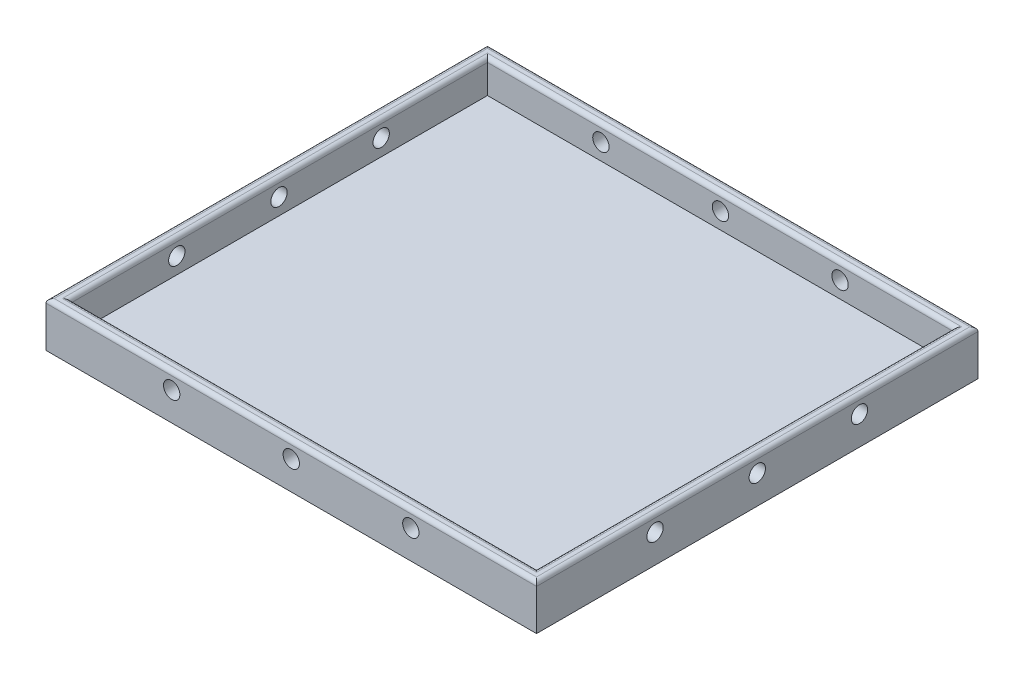
ISO-10303-21;
HEADER;
FILE_DESCRIPTION(('STEP AP214'),'2;1');
FILE_NAME('part.step','',(''),(''),'','','');
FILE_SCHEMA(('AUTOMOTIVE_DESIGN { 1 0 10303 214 1 1 1 1 }'));
ENDSEC;
DATA;
#1=APPLICATION_CONTEXT('core data for automotive mechanical design processes');
#2=APPLICATION_PROTOCOL_DEFINITION('international standard','automotive_design',2000,#1);
#3=PRODUCT_CONTEXT('',#1,'mechanical');
#4=PRODUCT('Part','Part','',(#3));
#5=PRODUCT_RELATED_PRODUCT_CATEGORY('part','',(#4));
#6=PRODUCT_DEFINITION_FORMATION('','',#4);
#7=PRODUCT_DEFINITION_CONTEXT('part definition',#1,'design');
#8=PRODUCT_DEFINITION('design','',#6,#7);
#9=PRODUCT_DEFINITION_SHAPE('','',#8);
#10=(LENGTH_UNIT() NAMED_UNIT(*) SI_UNIT(.MILLI.,.METRE.));
#11=(NAMED_UNIT(*) PLANE_ANGLE_UNIT() SI_UNIT($,.RADIAN.));
#12=(NAMED_UNIT(*) SI_UNIT($,.STERADIAN.) SOLID_ANGLE_UNIT());
#13=UNCERTAINTY_MEASURE_WITH_UNIT(LENGTH_MEASURE(1.E-05),#10,'distance_accuracy_value','');
#14=(GEOMETRIC_REPRESENTATION_CONTEXT(3) GLOBAL_UNCERTAINTY_ASSIGNED_CONTEXT((#13)) GLOBAL_UNIT_ASSIGNED_CONTEXT((#10,
#11,#12)) REPRESENTATION_CONTEXT('',''));
#15=CARTESIAN_POINT('',(0.,0.,0.));
#16=DIRECTION('',(0.,0.,1.));
#17=DIRECTION('',(1.,0.,0.));
#18=AXIS2_PLACEMENT_3D('',#15,#16,#17);
#19=CARTESIAN_POINT('',(-201.609907120743,11.,-77.8947368421052));
#20=DIRECTION('',(1.,0.,0.));
#21=DIRECTION('',(0.,0.,-1.));
#22=AXIS2_PLACEMENT_3D('',#19,#20,#21);
#23=PLANE('',#22);
#24=CARTESIAN_POINT('',(-201.609907120743,6.99999997663109,1.10526315789477));
#25=DIRECTION('',(1.,0.,0.));
#26=DIRECTION('',(0.,0.,-1.));
#27=AXIS2_PLACEMENT_3D('',#24,#25,#26);
#28=CIRCLE('',#27,1.9999999931676);
#29=CARTESIAN_POINT('',(-201.609907120743,6.99999997663109,-0.894736835272832));
#30=VERTEX_POINT('',#29);
#31=EDGE_CURVE('E191',#30,#30,#28,.T.);
#32=ORIENTED_EDGE('',*,*,#31,.T.);
#33=EDGE_LOOP('',(#32));
#34=FACE_BOUND('',#33,.T.);
#35=CARTESIAN_POINT('',(-201.609907120743,6.99999997663109,-23.8947368421052));
#36=DIRECTION('',(1.,0.,0.));
#37=DIRECTION('',(0.,0.,-1.));
#38=AXIS2_PLACEMENT_3D('',#35,#36,#37);
#39=CIRCLE('',#38,2.);
#40=CARTESIAN_POINT('',(-201.609907120743,6.99999997663109,-25.8947368421052));
#41=VERTEX_POINT('',#40);
#42=EDGE_CURVE('E594',#41,#41,#39,.T.);
#43=ORIENTED_EDGE('',*,*,#42,.T.);
#44=EDGE_LOOP('',(#43));
#45=FACE_BOUND('',#44,.T.);
#46=CARTESIAN_POINT('',(-201.609907120743,7.,-48.8947368421052));
#47=DIRECTION('',(1.,0.,0.));
#48=DIRECTION('',(0.,0.,-1.));
#49=AXIS2_PLACEMENT_3D('',#46,#47,#48);
#50=CIRCLE('',#49,2.);
#51=CARTESIAN_POINT('',(-201.609907120743,7.,-50.8947368421052));
#52=VERTEX_POINT('',#51);
#53=EDGE_CURVE('E587',#52,#52,#50,.T.);
#54=ORIENTED_EDGE('',*,*,#53,.T.);
#55=EDGE_LOOP('',(#54));
#56=FACE_BOUND('',#55,.T.);
#57=DIRECTION('',(0.,-1.,0.));
#58=VECTOR('',#57,1.);
#59=CARTESIAN_POINT('',(-201.609907120743,11.,30.1052631578948));
#60=LINE('',#59,#58);
#61=CARTESIAN_POINT('',(-201.609907120743,10.,30.1052631578948));
#62=VERTEX_POINT('',#61);
#63=CARTESIAN_POINT('',(-201.609907120743,0.,30.1052631578948));
#64=VERTEX_POINT('',#63);
#65=EDGE_CURVE('E184',#62,#64,#60,.T.);
#66=ORIENTED_EDGE('',*,*,#65,.F.);
#67=DIRECTION('',(0.,0.,1.));
#68=VECTOR('',#67,1.);
#69=CARTESIAN_POINT('',(-201.609907120743,10.,-77.8947368421052));
#70=LINE('',#69,#68);
#71=CARTESIAN_POINT('',(-201.609907120743,10.,-77.8947368421052));
#72=VERTEX_POINT('',#71);
#73=EDGE_CURVE('E45',#62,#72,#70,.F.);
#74=ORIENTED_EDGE('',*,*,#73,.T.);
#75=DIRECTION('',(0.,-1.,0.));
#76=VECTOR('',#75,1.);
#77=CARTESIAN_POINT('',(-201.609907120743,11.,-77.8947368421052));
#78=LINE('',#77,#76);
#79=CARTESIAN_POINT('',(-201.609907120743,0.,-77.8947368421052));
#80=VERTEX_POINT('',#79);
#81=EDGE_CURVE('E178',#72,#80,#78,.T.);
#82=ORIENTED_EDGE('',*,*,#81,.T.);
#83=DIRECTION('',(0.,0.,1.));
#84=VECTOR('',#83,1.);
#85=CARTESIAN_POINT('',(-201.609907120743,0.,-77.8947368421052));
#86=LINE('',#85,#84);
#87=EDGE_CURVE('E163',#80,#64,#86,.T.);
#88=ORIENTED_EDGE('',*,*,#87,.T.);
#89=EDGE_LOOP('',(#66,#74,#82,#88));
#90=FACE_BOUND('',#89,.T.);
#91=ADVANCED_FACE('F36',(#34,#45,#56,#90),#23,.F.);
#92=CARTESIAN_POINT('',(-201.609907120743,11.,30.1052631578948));
#93=DIRECTION('',(0.,0.,-1.));
#94=DIRECTION('',(-1.,0.,0.));
#95=AXIS2_PLACEMENT_3D('',#92,#93,#94);
#96=PLANE('',#95);
#97=CARTESIAN_POINT('',(-170.859907120743,7.,30.1052631578948));
#98=DIRECTION('',(0.,0.,1.));
#99=DIRECTION('',(1.,0.,0.));
#100=AXIS2_PLACEMENT_3D('',#97,#98,#99);
#101=CIRCLE('',#100,2.);
#102=CARTESIAN_POINT('',(-168.859907120743,7.,30.1052631578948));
#103=VERTEX_POINT('',#102);
#104=EDGE_CURVE('E622',#103,#103,#101,.T.);
#105=ORIENTED_EDGE('',*,*,#104,.F.);
#106=EDGE_LOOP('',(#105));
#107=FACE_BOUND('',#106,.T.);
#108=CARTESIAN_POINT('',(-141.609907120743,7.,30.1052631578948));
#109=DIRECTION('',(0.,0.,1.));
#110=DIRECTION('',(1.,0.,0.));
#111=AXIS2_PLACEMENT_3D('',#108,#109,#110);
#112=CIRCLE('',#111,2.);
#113=CARTESIAN_POINT('',(-139.609907120743,7.,30.1052631578948));
#114=VERTEX_POINT('',#113);
#115=EDGE_CURVE('E616',#114,#114,#112,.T.);
#116=ORIENTED_EDGE('',*,*,#115,.F.);
#117=EDGE_LOOP('',(#116));
#118=FACE_BOUND('',#117,.T.);
#119=CARTESIAN_POINT('',(-112.359907120743,7.,30.1052631578948));
#120=DIRECTION('',(0.,0.,1.));
#121=DIRECTION('',(1.,0.,0.));
#122=AXIS2_PLACEMENT_3D('',#119,#120,#121);
#123=CIRCLE('',#122,2.);
#124=CARTESIAN_POINT('',(-110.359907120743,7.,30.1052631578948));
#125=VERTEX_POINT('',#124);
#126=EDGE_CURVE('E250',#125,#125,#123,.T.);
#127=ORIENTED_EDGE('',*,*,#126,.F.);
#128=EDGE_LOOP('',(#127));
#129=FACE_BOUND('',#128,.T.);
#130=DIRECTION('',(0.,-1.,0.));
#131=VECTOR('',#130,1.);
#132=CARTESIAN_POINT('',(-81.6099071207431,11.,30.1052631578948));
#133=LINE('',#132,#131);
#134=CARTESIAN_POINT('',(-81.6099071207431,10.,30.1052631578948));
#135=VERTEX_POINT('',#134);
#136=CARTESIAN_POINT('',(-81.6099071207431,0.,30.1052631578948));
#137=VERTEX_POINT('',#136);
#138=EDGE_CURVE('E182',#135,#137,#133,.T.);
#139=ORIENTED_EDGE('',*,*,#138,.F.);
#140=DIRECTION('',(1.,0.,0.));
#141=VECTOR('',#140,1.);
#142=CARTESIAN_POINT('',(-201.609907120743,10.,30.1052631578948));
#143=LINE('',#142,#141);
#144=EDGE_CURVE('E230',#135,#62,#143,.F.);
#145=ORIENTED_EDGE('',*,*,#144,.T.);
#146=ORIENTED_EDGE('',*,*,#65,.T.);
#147=DIRECTION('',(1.,0.,0.));
#148=VECTOR('',#147,1.);
#149=CARTESIAN_POINT('',(-201.609907120743,0.,30.1052631578948));
#150=LINE('',#149,#148);
#151=EDGE_CURVE('E169',#64,#137,#150,.T.);
#152=ORIENTED_EDGE('',*,*,#151,.T.);
#153=EDGE_LOOP('',(#139,#145,#146,#152));
#154=FACE_BOUND('',#153,.T.);
#155=ADVANCED_FACE('F282',(#107,#118,#129,#154),#96,.F.);
#156=CARTESIAN_POINT('',(-81.6099071207431,11.,-77.8947368421052));
#157=DIRECTION('',(-1.,0.,0.));
#158=DIRECTION('',(0.,0.,1.));
#159=AXIS2_PLACEMENT_3D('',#156,#157,#158);
#160=PLANE('',#159);
#161=CARTESIAN_POINT('',(-81.6099071207431,6.99999997663109,1.10526315789477));
#162=DIRECTION('',(1.,0.,0.));
#163=DIRECTION('',(0.,0.,-1.));
#164=AXIS2_PLACEMENT_3D('',#161,#162,#163);
#165=CIRCLE('',#164,1.9999999931676);
#166=CARTESIAN_POINT('',(-81.6099071207431,6.99999997663109,-0.894736835272832));
#167=VERTEX_POINT('',#166);
#168=EDGE_CURVE('E579',#167,#167,#165,.T.);
#169=ORIENTED_EDGE('',*,*,#168,.F.);
#170=EDGE_LOOP('',(#169));
#171=FACE_BOUND('',#170,.T.);
#172=CARTESIAN_POINT('',(-81.6099071207431,6.99999997663109,-23.8947368421052));
#173=DIRECTION('',(1.,0.,0.));
#174=DIRECTION('',(0.,0.,-1.));
#175=AXIS2_PLACEMENT_3D('',#172,#173,#174);
#176=CIRCLE('',#175,2.);
#177=CARTESIAN_POINT('',(-81.6099071207431,6.99999997663109,-25.8947368421052));
#178=VERTEX_POINT('',#177);
#179=EDGE_CURVE('E583',#178,#178,#176,.T.);
#180=ORIENTED_EDGE('',*,*,#179,.F.);
#181=EDGE_LOOP('',(#180));
#182=FACE_BOUND('',#181,.T.);
#183=CARTESIAN_POINT('',(-81.6099071207431,7.,-48.8947368421052));
#184=DIRECTION('',(1.,0.,0.));
#185=DIRECTION('',(0.,0.,-1.));
#186=AXIS2_PLACEMENT_3D('',#183,#184,#185);
#187=CIRCLE('',#186,2.);
#188=CARTESIAN_POINT('',(-81.6099071207431,7.,-50.8947368421052));
#189=VERTEX_POINT('',#188);
#190=EDGE_CURVE('E586',#189,#189,#187,.T.);
#191=ORIENTED_EDGE('',*,*,#190,.F.);
#192=EDGE_LOOP('',(#191));
#193=FACE_BOUND('',#192,.T.);
#194=DIRECTION('',(0.,-1.,0.));
#195=VECTOR('',#194,1.);
#196=CARTESIAN_POINT('',(-81.6099071207431,11.,-77.8947368421052));
#197=LINE('',#196,#195);
#198=CARTESIAN_POINT('',(-81.6099071207431,10.,-77.8947368421052));
#199=VERTEX_POINT('',#198);
#200=CARTESIAN_POINT('',(-81.6099071207431,0.,-77.8947368421052));
#201=VERTEX_POINT('',#200);
#202=EDGE_CURVE('E180',#199,#201,#197,.T.);
#203=ORIENTED_EDGE('',*,*,#202,.F.);
#204=DIRECTION('',(0.,0.,-1.));
#205=VECTOR('',#204,1.);
#206=CARTESIAN_POINT('',(-81.6099071207431,10.,30.1052631578948));
#207=LINE('',#206,#205);
#208=EDGE_CURVE('E233',#199,#135,#207,.F.);
#209=ORIENTED_EDGE('',*,*,#208,.T.);
#210=ORIENTED_EDGE('',*,*,#138,.T.);
#211=DIRECTION('',(0.,0.,-1.));
#212=VECTOR('',#211,1.);
#213=CARTESIAN_POINT('',(-81.6099071207431,0.,-77.8947368421052));
#214=LINE('',#213,#212);
#215=EDGE_CURVE('E172',#137,#201,#214,.T.);
#216=ORIENTED_EDGE('',*,*,#215,.T.);
#217=EDGE_LOOP('',(#203,#209,#210,#216));
#218=FACE_BOUND('',#217,.T.);
#219=ADVANCED_FACE('F273',(#171,#182,#193,#218),#160,.F.);
#220=CARTESIAN_POINT('',(-201.609907120743,11.,-77.8947368421052));
#221=DIRECTION('',(0.,0.,1.));
#222=DIRECTION('',(1.,0.,0.));
#223=AXIS2_PLACEMENT_3D('',#220,#221,#222);
#224=PLANE('',#223);
#225=CARTESIAN_POINT('',(-170.859907120743,7.,-77.8947368421052));
#226=DIRECTION('',(0.,0.,1.));
#227=DIRECTION('',(1.,0.,0.));
#228=AXIS2_PLACEMENT_3D('',#225,#226,#227);
#229=CIRCLE('',#228,2.);
#230=CARTESIAN_POINT('',(-168.859907120743,7.,-77.8947368421052));
#231=VERTEX_POINT('',#230);
#232=EDGE_CURVE('E202',#231,#231,#229,.T.);
#233=ORIENTED_EDGE('',*,*,#232,.T.);
#234=EDGE_LOOP('',(#233));
#235=FACE_BOUND('',#234,.T.);
#236=CARTESIAN_POINT('',(-141.609907120743,7.,-77.8947368421052));
#237=DIRECTION('',(0.,0.,1.));
#238=DIRECTION('',(1.,0.,0.));
#239=AXIS2_PLACEMENT_3D('',#236,#237,#238);
#240=CIRCLE('',#239,2.);
#241=CARTESIAN_POINT('',(-139.609907120743,7.,-77.8947368421052));
#242=VERTEX_POINT('',#241);
#243=EDGE_CURVE('E619',#242,#242,#240,.T.);
#244=ORIENTED_EDGE('',*,*,#243,.T.);
#245=EDGE_LOOP('',(#244));
#246=FACE_BOUND('',#245,.T.);
#247=CARTESIAN_POINT('',(-112.359907120743,7.,-77.8947368421052));
#248=DIRECTION('',(0.,0.,1.));
#249=DIRECTION('',(1.,0.,0.));
#250=AXIS2_PLACEMENT_3D('',#247,#248,#249);
#251=CIRCLE('',#250,2.);
#252=CARTESIAN_POINT('',(-110.359907120743,7.,-77.8947368421052));
#253=VERTEX_POINT('',#252);
#254=EDGE_CURVE('E613',#253,#253,#251,.T.);
#255=ORIENTED_EDGE('',*,*,#254,.T.);
#256=EDGE_LOOP('',(#255));
#257=FACE_BOUND('',#256,.T.);
#258=ORIENTED_EDGE('',*,*,#81,.F.);
#259=DIRECTION('',(-1.,0.,0.));
#260=VECTOR('',#259,1.);
#261=CARTESIAN_POINT('',(-81.6099071207431,10.,-77.8947368421052));
#262=LINE('',#261,#260);
#263=EDGE_CURVE('E11',#72,#199,#262,.F.);
#264=ORIENTED_EDGE('',*,*,#263,.T.);
#265=ORIENTED_EDGE('',*,*,#202,.T.);
#266=DIRECTION('',(-1.,0.,0.));
#267=VECTOR('',#266,1.);
#268=CARTESIAN_POINT('',(-201.609907120743,0.,-77.8947368421052));
#269=LINE('',#268,#267);
#270=EDGE_CURVE('E175',#201,#80,#269,.T.);
#271=ORIENTED_EDGE('',*,*,#270,.T.);
#272=EDGE_LOOP('',(#258,#264,#265,#271));
#273=FACE_BOUND('',#272,.T.);
#274=ADVANCED_FACE('F271',(#235,#246,#257,#273),#224,.F.);
#275=CARTESIAN_POINT('',(0.,11.,0.));
#276=DIRECTION('',(0.,1.,0.));
#277=DIRECTION('',(0.,0.,1.));
#278=AXIS2_PLACEMENT_3D('',#275,#276,#277);
#279=PLANE('',#278);
#280=DIRECTION('',(0.,0.,-1.));
#281=VECTOR('',#280,1.);
#282=CARTESIAN_POINT('',(-83.6099071207431,11.,27.1052631578948));
#283=LINE('',#282,#281);
#284=CARTESIAN_POINT('',(-83.6099071207431,11.,-75.8947368421052));
#285=VERTEX_POINT('',#284);
#286=CARTESIAN_POINT('',(-83.6099071207431,11.,28.1052631578948));
#287=VERTEX_POINT('',#286);
#288=EDGE_CURVE('E225',#285,#287,#283,.F.);
#289=ORIENTED_EDGE('',*,*,#288,.T.);
#290=DIRECTION('',(1.,0.,0.));
#291=VECTOR('',#290,1.);
#292=CARTESIAN_POINT('',(-198.609907120743,11.,28.1052631578948));
#293=LINE('',#292,#291);
#294=CARTESIAN_POINT('',(-199.609907120743,11.,28.1052631578948));
#295=VERTEX_POINT('',#294);
#296=EDGE_CURVE('E227',#287,#295,#293,.F.);
#297=ORIENTED_EDGE('',*,*,#296,.T.);
#298=DIRECTION('',(0.,0.,1.));
#299=VECTOR('',#298,1.);
#300=CARTESIAN_POINT('',(-199.609907120743,11.,-74.8947368421052));
#301=LINE('',#300,#299);
#302=CARTESIAN_POINT('',(-199.609907120743,11.,-75.8947368421052));
#303=VERTEX_POINT('',#302);
#304=EDGE_CURVE('E223',#295,#303,#301,.F.);
#305=ORIENTED_EDGE('',*,*,#304,.T.);
#306=DIRECTION('',(-1.,0.,0.));
#307=VECTOR('',#306,1.);
#308=CARTESIAN_POINT('',(-84.6099071207431,11.,-75.8947368421052));
#309=LINE('',#308,#307);
#310=EDGE_CURVE('E221',#303,#285,#309,.F.);
#311=ORIENTED_EDGE('',*,*,#310,.T.);
#312=EDGE_LOOP('',(#289,#297,#305,#311));
#313=FACE_BOUND('',#312,.T.);
#314=DIRECTION('',(0.,0.,1.));
#315=VECTOR('',#314,1.);
#316=CARTESIAN_POINT('',(-200.609907120743,11.,30.1052631578948));
#317=LINE('',#316,#315);
#318=CARTESIAN_POINT('',(-200.609907120743,11.,-76.8947368421052));
#319=VERTEX_POINT('',#318);
#320=CARTESIAN_POINT('',(-200.609907120743,11.,29.1052631578948));
#321=VERTEX_POINT('',#320);
#322=EDGE_CURVE('E214',#319,#321,#317,.T.);
#323=ORIENTED_EDGE('',*,*,#322,.T.);
#324=DIRECTION('',(1.,0.,0.));
#325=VECTOR('',#324,1.);
#326=CARTESIAN_POINT('',(-81.6099071207431,11.,29.1052631578948));
#327=LINE('',#326,#325);
#328=CARTESIAN_POINT('',(-82.6099071207431,11.,29.1052631578948));
#329=VERTEX_POINT('',#328);
#330=EDGE_CURVE('E218',#321,#329,#327,.T.);
#331=ORIENTED_EDGE('',*,*,#330,.T.);
#332=DIRECTION('',(0.,0.,-1.));
#333=VECTOR('',#332,1.);
#334=CARTESIAN_POINT('',(-82.6099071207431,11.,-77.8947368421052));
#335=LINE('',#334,#333);
#336=CARTESIAN_POINT('',(-82.6099071207431,11.,-76.8947368421052));
#337=VERTEX_POINT('',#336);
#338=EDGE_CURVE('E216',#329,#337,#335,.T.);
#339=ORIENTED_EDGE('',*,*,#338,.T.);
#340=DIRECTION('',(-1.,0.,0.));
#341=VECTOR('',#340,1.);
#342=CARTESIAN_POINT('',(-201.609907120743,11.,-76.8947368421052));
#343=LINE('',#342,#341);
#344=EDGE_CURVE('E212',#337,#319,#343,.T.);
#345=ORIENTED_EDGE('',*,*,#344,.T.);
#346=EDGE_LOOP('',(#323,#331,#339,#345));
#347=FACE_BOUND('',#346,.T.);
#348=ADVANCED_FACE('F290',(#313,#347),#279,.T.);
#349=CARTESIAN_POINT('',(0.,0.,0.));
#350=DIRECTION('',(0.,1.,0.));
#351=DIRECTION('',(0.,0.,1.));
#352=AXIS2_PLACEMENT_3D('',#349,#350,#351);
#353=PLANE('',#352);
#354=ORIENTED_EDGE('',*,*,#87,.F.);
#355=ORIENTED_EDGE('',*,*,#270,.F.);
#356=ORIENTED_EDGE('',*,*,#215,.F.);
#357=ORIENTED_EDGE('',*,*,#151,.F.);
#358=EDGE_LOOP('',(#354,#355,#356,#357));
#359=FACE_BOUND('',#358,.T.);
#360=ADVANCED_FACE('F280',(#359),#353,.F.);
#361=CARTESIAN_POINT('',(-198.609907120743,3.,-74.8947368421052));
#362=DIRECTION('',(-1.,0.,0.));
#363=DIRECTION('',(0.,0.,1.));
#364=AXIS2_PLACEMENT_3D('',#361,#362,#363);
#365=PLANE('',#364);
#366=CARTESIAN_POINT('',(-198.609907120743,6.99999997663109,1.10526315789477));
#367=DIRECTION('',(-1.,0.,0.));
#368=DIRECTION('',(0.,0.,1.));
#369=AXIS2_PLACEMENT_3D('',#366,#367,#368);
#370=CIRCLE('',#369,1.9999999931676);
#371=CARTESIAN_POINT('',(-198.609907120743,6.99999997663109,3.10526315106236));
#372=VERTEX_POINT('',#371);
#373=EDGE_CURVE('E152',#372,#372,#370,.T.);
#374=ORIENTED_EDGE('',*,*,#373,.T.);
#375=EDGE_LOOP('',(#374));
#376=FACE_BOUND('',#375,.T.);
#377=CARTESIAN_POINT('',(-198.609907120743,6.99999997663109,-23.8947368421052));
#378=DIRECTION('',(-1.,0.,0.));
#379=DIRECTION('',(0.,0.,1.));
#380=AXIS2_PLACEMENT_3D('',#377,#378,#379);
#381=CIRCLE('',#380,2.);
#382=CARTESIAN_POINT('',(-198.609907120743,6.99999997663109,-21.8947368421052));
#383=VERTEX_POINT('',#382);
#384=EDGE_CURVE('E195',#383,#383,#381,.T.);
#385=ORIENTED_EDGE('',*,*,#384,.T.);
#386=EDGE_LOOP('',(#385));
#387=FACE_BOUND('',#386,.T.);
#388=CARTESIAN_POINT('',(-198.609907120743,7.,-48.8947368421052));
#389=DIRECTION('',(-1.,0.,0.));
#390=DIRECTION('',(0.,0.,1.));
#391=AXIS2_PLACEMENT_3D('',#388,#389,#390);
#392=CIRCLE('',#391,2.);
#393=CARTESIAN_POINT('',(-198.609907120743,7.,-46.8947368421052));
#394=VERTEX_POINT('',#393);
#395=EDGE_CURVE('E190',#394,#394,#392,.T.);
#396=ORIENTED_EDGE('',*,*,#395,.T.);
#397=EDGE_LOOP('',(#396));
#398=FACE_BOUND('',#397,.T.);
#399=DIRECTION('',(0.,1.,0.));
#400=VECTOR('',#399,1.);
#401=CARTESIAN_POINT('',(-198.609907120743,3.,-74.8947368421052));
#402=LINE('',#401,#400);
#403=CARTESIAN_POINT('',(-198.609907120743,3.,-74.8947368421052));
#404=VERTEX_POINT('',#403);
#405=CARTESIAN_POINT('',(-198.609907120743,10.,-74.8947368421052));
#406=VERTEX_POINT('',#405);
#407=EDGE_CURVE('E161',#404,#406,#402,.T.);
#408=ORIENTED_EDGE('',*,*,#407,.T.);
#409=DIRECTION('',(0.,0.,1.));
#410=VECTOR('',#409,1.);
#411=CARTESIAN_POINT('',(-198.609907120743,10.,27.1052631578948));
#412=LINE('',#411,#410);
#413=CARTESIAN_POINT('',(-198.609907120743,10.,27.1052631578948));
#414=VERTEX_POINT('',#413);
#415=EDGE_CURVE('E134',#406,#414,#412,.T.);
#416=ORIENTED_EDGE('',*,*,#415,.T.);
#417=DIRECTION('',(0.,1.,0.));
#418=VECTOR('',#417,1.);
#419=CARTESIAN_POINT('',(-198.609907120743,3.,27.1052631578948));
#420=LINE('',#419,#418);
#421=CARTESIAN_POINT('',(-198.609907120743,3.,27.1052631578948));
#422=VERTEX_POINT('',#421);
#423=EDGE_CURVE('E127',#422,#414,#420,.T.);
#424=ORIENTED_EDGE('',*,*,#423,.F.);
#425=DIRECTION('',(0.,0.,1.));
#426=VECTOR('',#425,1.);
#427=CARTESIAN_POINT('',(-198.609907120743,3.,-74.8947368421052));
#428=LINE('',#427,#426);
#429=EDGE_CURVE('E131',#404,#422,#428,.T.);
#430=ORIENTED_EDGE('',*,*,#429,.F.);
#431=EDGE_LOOP('',(#408,#416,#424,#430));
#432=FACE_BOUND('',#431,.T.);
#433=ADVANCED_FACE('F129',(#376,#387,#398,#432),#365,.F.);
#434=CARTESIAN_POINT('',(-198.609907120743,3.,-74.8947368421052));
#435=DIRECTION('',(0.,0.,-1.));
#436=DIRECTION('',(-1.,0.,0.));
#437=AXIS2_PLACEMENT_3D('',#434,#435,#436);
#438=PLANE('',#437);
#439=CARTESIAN_POINT('',(-170.859907120743,7.,-74.8947368421052));
#440=DIRECTION('',(0.,0.,-1.));
#441=DIRECTION('',(-1.,0.,0.));
#442=AXIS2_PLACEMENT_3D('',#439,#440,#441);
#443=CIRCLE('',#442,2.);
#444=CARTESIAN_POINT('',(-172.859907120743,7.,-74.8947368421052));
#445=VERTEX_POINT('',#444);
#446=EDGE_CURVE('E210',#445,#445,#443,.T.);
#447=ORIENTED_EDGE('',*,*,#446,.T.);
#448=EDGE_LOOP('',(#447));
#449=FACE_BOUND('',#448,.T.);
#450=CARTESIAN_POINT('',(-141.609907120743,7.,-74.8947368421052));
#451=DIRECTION('',(0.,0.,-1.));
#452=DIRECTION('',(-1.,0.,0.));
#453=AXIS2_PLACEMENT_3D('',#450,#451,#452);
#454=CIRCLE('',#453,2.);
#455=CARTESIAN_POINT('',(-143.609907120743,7.,-74.8947368421052));
#456=VERTEX_POINT('',#455);
#457=EDGE_CURVE('E206',#456,#456,#454,.T.);
#458=ORIENTED_EDGE('',*,*,#457,.T.);
#459=EDGE_LOOP('',(#458));
#460=FACE_BOUND('',#459,.T.);
#461=CARTESIAN_POINT('',(-112.359907120743,7.,-74.8947368421052));
#462=DIRECTION('',(0.,0.,-1.));
#463=DIRECTION('',(-1.,0.,0.));
#464=AXIS2_PLACEMENT_3D('',#461,#462,#463);
#465=CIRCLE('',#464,2.);
#466=CARTESIAN_POINT('',(-114.359907120743,7.,-74.8947368421052));
#467=VERTEX_POINT('',#466);
#468=EDGE_CURVE('E201',#467,#467,#465,.T.);
#469=ORIENTED_EDGE('',*,*,#468,.T.);
#470=EDGE_LOOP('',(#469));
#471=FACE_BOUND('',#470,.T.);
#472=DIRECTION('',(0.,1.,0.));
#473=VECTOR('',#472,1.);
#474=CARTESIAN_POINT('',(-84.6099071207431,3.,-74.8947368421052));
#475=LINE('',#474,#473);
#476=CARTESIAN_POINT('',(-84.6099071207431,3.,-74.8947368421052));
#477=VERTEX_POINT('',#476);
#478=CARTESIAN_POINT('',(-84.6099071207431,10.,-74.8947368421052));
#479=VERTEX_POINT('',#478);
#480=EDGE_CURVE('E164',#477,#479,#475,.T.);
#481=ORIENTED_EDGE('',*,*,#480,.T.);
#482=DIRECTION('',(-1.,0.,0.));
#483=VECTOR('',#482,1.);
#484=CARTESIAN_POINT('',(-198.609907120743,10.,-74.8947368421052));
#485=LINE('',#484,#483);
#486=EDGE_CURVE('E60',#479,#406,#485,.T.);
#487=ORIENTED_EDGE('',*,*,#486,.T.);
#488=ORIENTED_EDGE('',*,*,#407,.F.);
#489=DIRECTION('',(-1.,0.,0.));
#490=VECTOR('',#489,1.);
#491=CARTESIAN_POINT('',(-198.609907120743,3.,-74.8947368421052));
#492=LINE('',#491,#490);
#493=EDGE_CURVE('E139',#477,#404,#492,.T.);
#494=ORIENTED_EDGE('',*,*,#493,.F.);
#495=EDGE_LOOP('',(#481,#487,#488,#494));
#496=FACE_BOUND('',#495,.T.);
#497=ADVANCED_FACE('F466',(#449,#460,#471,#496),#438,.F.);
#498=CARTESIAN_POINT('',(-84.6099071207431,3.,-74.8947368421052));
#499=DIRECTION('',(1.,0.,0.));
#500=DIRECTION('',(0.,0.,-1.));
#501=AXIS2_PLACEMENT_3D('',#498,#499,#500);
#502=PLANE('',#501);
#503=CARTESIAN_POINT('',(-84.6099071207431,6.99999997663109,1.10526315789477));
#504=DIRECTION('',(1.,0.,0.));
#505=DIRECTION('',(0.,0.,-1.));
#506=AXIS2_PLACEMENT_3D('',#503,#504,#505);
#507=CIRCLE('',#506,1.9999999931676);
#508=CARTESIAN_POINT('',(-84.6099071207431,6.99999997663109,-0.894736835272832));
#509=VERTEX_POINT('',#508);
#510=EDGE_CURVE('E155',#509,#509,#507,.T.);
#511=ORIENTED_EDGE('',*,*,#510,.T.);
#512=EDGE_LOOP('',(#511));
#513=FACE_BOUND('',#512,.T.);
#514=CARTESIAN_POINT('',(-84.6099071207431,6.99999997663109,-23.8947368421052));
#515=DIRECTION('',(1.,0.,0.));
#516=DIRECTION('',(0.,0.,-1.));
#517=AXIS2_PLACEMENT_3D('',#514,#515,#516);
#518=CIRCLE('',#517,2.);
#519=CARTESIAN_POINT('',(-84.6099071207431,6.99999997663109,-25.8947368421052));
#520=VERTEX_POINT('',#519);
#521=EDGE_CURVE('E192',#520,#520,#518,.T.);
#522=ORIENTED_EDGE('',*,*,#521,.T.);
#523=EDGE_LOOP('',(#522));
#524=FACE_BOUND('',#523,.T.);
#525=CARTESIAN_POINT('',(-84.6099071207431,7.,-48.8947368421052));
#526=DIRECTION('',(1.,0.,0.));
#527=DIRECTION('',(0.,0.,-1.));
#528=AXIS2_PLACEMENT_3D('',#525,#526,#527);
#529=CIRCLE('',#528,2.);
#530=CARTESIAN_POINT('',(-84.6099071207431,7.,-50.8947368421052));
#531=VERTEX_POINT('',#530);
#532=EDGE_CURVE('E187',#531,#531,#529,.T.);
#533=ORIENTED_EDGE('',*,*,#532,.T.);
#534=EDGE_LOOP('',(#533));
#535=FACE_BOUND('',#534,.T.);
#536=DIRECTION('',(0.,1.,0.));
#537=VECTOR('',#536,1.);
#538=CARTESIAN_POINT('',(-84.6099071207431,3.,27.1052631578948));
#539=LINE('',#538,#537);
#540=CARTESIAN_POINT('',(-84.6099071207431,3.,27.1052631578948));
#541=VERTEX_POINT('',#540);
#542=CARTESIAN_POINT('',(-84.6099071207431,10.,27.1052631578948));
#543=VERTEX_POINT('',#542);
#544=EDGE_CURVE('E138',#541,#543,#539,.T.);
#545=ORIENTED_EDGE('',*,*,#544,.T.);
#546=DIRECTION('',(0.,0.,-1.));
#547=VECTOR('',#546,1.);
#548=CARTESIAN_POINT('',(-84.6099071207431,10.,-74.8947368421052));
#549=LINE('',#548,#547);
#550=EDGE_CURVE('E235',#543,#479,#549,.T.);
#551=ORIENTED_EDGE('',*,*,#550,.T.);
#552=ORIENTED_EDGE('',*,*,#480,.F.);
#553=DIRECTION('',(0.,0.,-1.));
#554=VECTOR('',#553,1.);
#555=CARTESIAN_POINT('',(-84.6099071207431,3.,-74.8947368421052));
#556=LINE('',#555,#554);
#557=EDGE_CURVE('E148',#541,#477,#556,.T.);
#558=ORIENTED_EDGE('',*,*,#557,.F.);
#559=EDGE_LOOP('',(#545,#551,#552,#558));
#560=FACE_BOUND('',#559,.T.);
#561=ADVANCED_FACE('F458',(#513,#524,#535,#560),#502,.F.);
#562=CARTESIAN_POINT('',(-198.609907120743,3.,27.1052631578948));
#563=DIRECTION('',(0.,0.,1.));
#564=DIRECTION('',(1.,0.,0.));
#565=AXIS2_PLACEMENT_3D('',#562,#563,#564);
#566=PLANE('',#565);
#567=CARTESIAN_POINT('',(-170.859907120743,7.,27.1052631578948));
#568=DIRECTION('',(0.,0.,1.));
#569=DIRECTION('',(1.,0.,0.));
#570=AXIS2_PLACEMENT_3D('',#567,#568,#569);
#571=CIRCLE('',#570,2.);
#572=CARTESIAN_POINT('',(-168.859907120743,7.,27.1052631578948));
#573=VERTEX_POINT('',#572);
#574=EDGE_CURVE('E207',#573,#573,#571,.T.);
#575=ORIENTED_EDGE('',*,*,#574,.T.);
#576=EDGE_LOOP('',(#575));
#577=FACE_BOUND('',#576,.T.);
#578=CARTESIAN_POINT('',(-141.609907120743,7.,27.1052631578948));
#579=DIRECTION('',(0.,0.,1.));
#580=DIRECTION('',(1.,0.,0.));
#581=AXIS2_PLACEMENT_3D('',#578,#579,#580);
#582=CIRCLE('',#581,2.);
#583=CARTESIAN_POINT('',(-139.609907120743,7.,27.1052631578948));
#584=VERTEX_POINT('',#583);
#585=EDGE_CURVE('E203',#584,#584,#582,.T.);
#586=ORIENTED_EDGE('',*,*,#585,.T.);
#587=EDGE_LOOP('',(#586));
#588=FACE_BOUND('',#587,.T.);
#589=CARTESIAN_POINT('',(-112.359907120743,7.,27.1052631578948));
#590=DIRECTION('',(0.,0.,1.));
#591=DIRECTION('',(1.,0.,0.));
#592=AXIS2_PLACEMENT_3D('',#589,#590,#591);
#593=CIRCLE('',#592,2.);
#594=CARTESIAN_POINT('',(-110.359907120743,7.,27.1052631578948));
#595=VERTEX_POINT('',#594);
#596=EDGE_CURVE('E198',#595,#595,#593,.T.);
#597=ORIENTED_EDGE('',*,*,#596,.T.);
#598=EDGE_LOOP('',(#597));
#599=FACE_BOUND('',#598,.T.);
#600=ORIENTED_EDGE('',*,*,#423,.T.);
#601=DIRECTION('',(1.,0.,0.));
#602=VECTOR('',#601,1.);
#603=CARTESIAN_POINT('',(-84.6099071207431,10.,27.1052631578948));
#604=LINE('',#603,#602);
#605=EDGE_CURVE('E186',#414,#543,#604,.T.);
#606=ORIENTED_EDGE('',*,*,#605,.T.);
#607=ORIENTED_EDGE('',*,*,#544,.F.);
#608=DIRECTION('',(1.,0.,0.));
#609=VECTOR('',#608,1.);
#610=CARTESIAN_POINT('',(-198.609907120743,3.,27.1052631578948));
#611=LINE('',#610,#609);
#612=EDGE_CURVE('E142',#422,#541,#611,.T.);
#613=ORIENTED_EDGE('',*,*,#612,.F.);
#614=EDGE_LOOP('',(#600,#606,#607,#613));
#615=FACE_BOUND('',#614,.T.);
#616=ADVANCED_FACE('F143',(#577,#588,#599,#615),#566,.F.);
#617=CARTESIAN_POINT('',(0.,3.,0.));
#618=DIRECTION('',(0.,1.,0.));
#619=DIRECTION('',(0.,0.,1.));
#620=AXIS2_PLACEMENT_3D('',#617,#618,#619);
#621=PLANE('',#620);
#622=ORIENTED_EDGE('',*,*,#429,.T.);
#623=ORIENTED_EDGE('',*,*,#612,.T.);
#624=ORIENTED_EDGE('',*,*,#557,.T.);
#625=ORIENTED_EDGE('',*,*,#493,.T.);
#626=EDGE_LOOP('',(#622,#623,#624,#625));
#627=FACE_BOUND('',#626,.T.);
#628=ADVANCED_FACE('F150',(#627),#621,.T.);
#629=CARTESIAN_POINT('',(-201.609907120743,7.,-48.8947368421052));
#630=DIRECTION('',(1.,0.,0.));
#631=DIRECTION('',(0.,0.,-1.));
#632=AXIS2_PLACEMENT_3D('',#629,#630,#631);
#633=CYLINDRICAL_SURFACE('',#632,2.);
#634=ORIENTED_EDGE('',*,*,#190,.T.);
#635=EDGE_LOOP('',(#634));
#636=FACE_BOUND('',#635,.T.);
#637=ORIENTED_EDGE('',*,*,#532,.F.);
#638=EDGE_LOOP('',(#637));
#639=FACE_BOUND('',#638,.T.);
#640=ADVANCED_FACE('F428',(#636,#639),#633,.F.);
#641=CARTESIAN_POINT('',(-201.609907120743,6.99999997663109,-23.8947368421052));
#642=DIRECTION('',(1.,0.,0.));
#643=DIRECTION('',(0.,0.,-1.));
#644=AXIS2_PLACEMENT_3D('',#641,#642,#643);
#645=CYLINDRICAL_SURFACE('',#644,2.);
#646=ORIENTED_EDGE('',*,*,#179,.T.);
#647=EDGE_LOOP('',(#646));
#648=FACE_BOUND('',#647,.T.);
#649=ORIENTED_EDGE('',*,*,#521,.F.);
#650=EDGE_LOOP('',(#649));
#651=FACE_BOUND('',#650,.T.);
#652=ADVANCED_FACE('F420',(#648,#651),#645,.F.);
#653=CARTESIAN_POINT('',(-201.609907120743,6.99999997663109,1.10526315789477));
#654=DIRECTION('',(1.,0.,0.));
#655=DIRECTION('',(0.,0.,-1.));
#656=AXIS2_PLACEMENT_3D('',#653,#654,#655);
#657=CYLINDRICAL_SURFACE('',#656,1.9999999931676);
#658=ORIENTED_EDGE('',*,*,#168,.T.);
#659=EDGE_LOOP('',(#658));
#660=FACE_BOUND('',#659,.T.);
#661=ORIENTED_EDGE('',*,*,#510,.F.);
#662=EDGE_LOOP('',(#661));
#663=FACE_BOUND('',#662,.T.);
#664=ADVANCED_FACE('F411',(#660,#663),#657,.F.);
#665=ORIENTED_EDGE('',*,*,#53,.F.);
#666=EDGE_LOOP('',(#665));
#667=FACE_BOUND('',#666,.T.);
#668=ORIENTED_EDGE('',*,*,#395,.F.);
#669=EDGE_LOOP('',(#668));
#670=FACE_BOUND('',#669,.T.);
#671=ADVANCED_FACE('F417',(#667,#670),#633,.F.);
#672=ORIENTED_EDGE('',*,*,#42,.F.);
#673=EDGE_LOOP('',(#672));
#674=FACE_BOUND('',#673,.T.);
#675=ORIENTED_EDGE('',*,*,#384,.F.);
#676=EDGE_LOOP('',(#675));
#677=FACE_BOUND('',#676,.T.);
#678=ADVANCED_FACE('F408',(#674,#677),#645,.F.);
#679=ORIENTED_EDGE('',*,*,#31,.F.);
#680=EDGE_LOOP('',(#679));
#681=FACE_BOUND('',#680,.T.);
#682=ORIENTED_EDGE('',*,*,#373,.F.);
#683=EDGE_LOOP('',(#682));
#684=FACE_BOUND('',#683,.T.);
#685=ADVANCED_FACE('F401',(#681,#684),#657,.F.);
#686=CARTESIAN_POINT('',(-112.359907120743,7.,-77.8947368421052));
#687=DIRECTION('',(0.,0.,1.));
#688=DIRECTION('',(1.,0.,0.));
#689=AXIS2_PLACEMENT_3D('',#686,#687,#688);
#690=CYLINDRICAL_SURFACE('',#689,2.);
#691=ORIENTED_EDGE('',*,*,#126,.T.);
#692=EDGE_LOOP('',(#691));
#693=FACE_BOUND('',#692,.T.);
#694=ORIENTED_EDGE('',*,*,#596,.F.);
#695=EDGE_LOOP('',(#694));
#696=FACE_BOUND('',#695,.T.);
#697=ADVANCED_FACE('F383',(#693,#696),#690,.F.);
#698=CARTESIAN_POINT('',(-141.609907120743,7.,-77.8947368421052));
#699=DIRECTION('',(0.,0.,1.));
#700=DIRECTION('',(1.,0.,0.));
#701=AXIS2_PLACEMENT_3D('',#698,#699,#700);
#702=CYLINDRICAL_SURFACE('',#701,2.);
#703=ORIENTED_EDGE('',*,*,#115,.T.);
#704=EDGE_LOOP('',(#703));
#705=FACE_BOUND('',#704,.T.);
#706=ORIENTED_EDGE('',*,*,#585,.F.);
#707=EDGE_LOOP('',(#706));
#708=FACE_BOUND('',#707,.T.);
#709=ADVANCED_FACE('F375',(#705,#708),#702,.F.);
#710=CARTESIAN_POINT('',(-170.859907120743,7.,-77.8947368421052));
#711=DIRECTION('',(0.,0.,1.));
#712=DIRECTION('',(1.,0.,0.));
#713=AXIS2_PLACEMENT_3D('',#710,#711,#712);
#714=CYLINDRICAL_SURFACE('',#713,2.);
#715=ORIENTED_EDGE('',*,*,#104,.T.);
#716=EDGE_LOOP('',(#715));
#717=FACE_BOUND('',#716,.T.);
#718=ORIENTED_EDGE('',*,*,#574,.F.);
#719=EDGE_LOOP('',(#718));
#720=FACE_BOUND('',#719,.T.);
#721=ADVANCED_FACE('F366',(#717,#720),#714,.F.);
#722=ORIENTED_EDGE('',*,*,#254,.F.);
#723=EDGE_LOOP('',(#722));
#724=FACE_BOUND('',#723,.T.);
#725=ORIENTED_EDGE('',*,*,#468,.F.);
#726=EDGE_LOOP('',(#725));
#727=FACE_BOUND('',#726,.T.);
#728=ADVANCED_FACE('F372',(#724,#727),#690,.F.);
#729=ORIENTED_EDGE('',*,*,#243,.F.);
#730=EDGE_LOOP('',(#729));
#731=FACE_BOUND('',#730,.T.);
#732=ORIENTED_EDGE('',*,*,#457,.F.);
#733=EDGE_LOOP('',(#732));
#734=FACE_BOUND('',#733,.T.);
#735=ADVANCED_FACE('F363',(#731,#734),#702,.F.);
#736=ORIENTED_EDGE('',*,*,#232,.F.);
#737=EDGE_LOOP('',(#736));
#738=FACE_BOUND('',#737,.T.);
#739=ORIENTED_EDGE('',*,*,#446,.F.);
#740=EDGE_LOOP('',(#739));
#741=FACE_BOUND('',#740,.T.);
#742=ADVANCED_FACE('F329',(#738,#741),#714,.F.);
#743=CARTESIAN_POINT('',(-198.609907120743,10.,-75.8947368421052));
#744=DIRECTION('',(1.,0.,0.));
#745=DIRECTION('',(0.,0.,-1.));
#746=AXIS2_PLACEMENT_3D('',#743,#744,#745);
#747=CYLINDRICAL_SURFACE('',#746,1.);
#748=CARTESIAN_POINT('',(-83.6099071207431,10.,-75.8947368421052));
#749=DIRECTION('',(0.707106781186548,0.,0.707106781186547));
#750=DIRECTION('',(-0.707106781186547,0.,0.707106781186548));
#751=AXIS2_PLACEMENT_3D('',#748,#749,#750);
#752=ELLIPSE('',#751,1.41421356237309,1.);
#753=EDGE_CURVE('E244',#285,#479,#752,.T.);
#754=ORIENTED_EDGE('',*,*,#753,.F.);
#755=ORIENTED_EDGE('',*,*,#310,.F.);
#756=CARTESIAN_POINT('',(-199.609907120743,10.,-75.8947368421052));
#757=DIRECTION('',(0.707106781186547,0.,-0.707106781186547));
#758=DIRECTION('',(-0.707106781186547,0.,-0.707106781186547));
#759=AXIS2_PLACEMENT_3D('',#756,#757,#758);
#760=ELLIPSE('',#759,1.41421356237309,1.);
#761=EDGE_CURVE('E247',#406,#303,#760,.F.);
#762=ORIENTED_EDGE('',*,*,#761,.F.);
#763=ORIENTED_EDGE('',*,*,#486,.F.);
#764=EDGE_LOOP('',(#754,#755,#762,#763));
#765=FACE_BOUND('',#764,.T.);
#766=ADVANCED_FACE('F325',(#765),#747,.T.);
#767=CARTESIAN_POINT('',(-199.609907120743,10.,-74.8947368421052));
#768=DIRECTION('',(0.,0.,-1.));
#769=DIRECTION('',(-1.,0.,0.));
#770=AXIS2_PLACEMENT_3D('',#767,#768,#769);
#771=CYLINDRICAL_SURFACE('',#770,1.);
#772=ORIENTED_EDGE('',*,*,#761,.T.);
#773=ORIENTED_EDGE('',*,*,#304,.F.);
#774=CARTESIAN_POINT('',(-199.609907120743,10.,28.1052631578948));
#775=DIRECTION('',(-0.707106781186547,0.,-0.707106781186547));
#776=DIRECTION('',(-0.707106781186547,0.,0.707106781186547));
#777=AXIS2_PLACEMENT_3D('',#774,#775,#776);
#778=ELLIPSE('',#777,1.41421356237309,1.);
#779=EDGE_CURVE('E242',#414,#295,#778,.F.);
#780=ORIENTED_EDGE('',*,*,#779,.F.);
#781=ORIENTED_EDGE('',*,*,#415,.F.);
#782=EDGE_LOOP('',(#772,#773,#780,#781));
#783=FACE_BOUND('',#782,.T.);
#784=ADVANCED_FACE('F321',(#783),#771,.T.);
#785=CARTESIAN_POINT('',(-83.6099071207431,10.,-74.8947368421052));
#786=DIRECTION('',(0.,0.,1.));
#787=DIRECTION('',(1.,0.,0.));
#788=AXIS2_PLACEMENT_3D('',#785,#786,#787);
#789=CYLINDRICAL_SURFACE('',#788,1.);
#790=ORIENTED_EDGE('',*,*,#753,.T.);
#791=ORIENTED_EDGE('',*,*,#550,.F.);
#792=CARTESIAN_POINT('',(-83.6099071207431,10.,28.1052631578948));
#793=DIRECTION('',(-0.707106781186547,0.,0.707106781186548));
#794=DIRECTION('',(-0.707106781186548,0.,-0.707106781186547));
#795=AXIS2_PLACEMENT_3D('',#792,#793,#794);
#796=ELLIPSE('',#795,1.4142135623731,1.);
#797=EDGE_CURVE('E240',#287,#543,#796,.T.);
#798=ORIENTED_EDGE('',*,*,#797,.F.);
#799=ORIENTED_EDGE('',*,*,#288,.F.);
#800=EDGE_LOOP('',(#790,#791,#798,#799));
#801=FACE_BOUND('',#800,.T.);
#802=ADVANCED_FACE('F317',(#801),#789,.T.);
#803=CARTESIAN_POINT('',(-198.609907120743,10.,28.1052631578948));
#804=DIRECTION('',(-1.,0.,0.));
#805=DIRECTION('',(0.,0.,1.));
#806=AXIS2_PLACEMENT_3D('',#803,#804,#805);
#807=CYLINDRICAL_SURFACE('',#806,1.);
#808=ORIENTED_EDGE('',*,*,#779,.T.);
#809=ORIENTED_EDGE('',*,*,#296,.F.);
#810=ORIENTED_EDGE('',*,*,#797,.T.);
#811=ORIENTED_EDGE('',*,*,#605,.F.);
#812=EDGE_LOOP('',(#808,#809,#810,#811));
#813=FACE_BOUND('',#812,.T.);
#814=ADVANCED_FACE('F314',(#813),#807,.T.);
#815=CARTESIAN_POINT('',(0.,10.,-76.8947368421052));
#816=DIRECTION('',(1.,0.,0.));
#817=DIRECTION('',(0.,0.,-1.));
#818=AXIS2_PLACEMENT_3D('',#815,#816,#817);
#819=CYLINDRICAL_SURFACE('',#818,1.);
#820=CARTESIAN_POINT('',(-82.6099071207431,10.,-76.8947368421052));
#821=DIRECTION('',(0.707106781186548,0.,0.707106781186547));
#822=DIRECTION('',(0.707106781186547,0.,-0.707106781186548));
#823=AXIS2_PLACEMENT_3D('',#820,#821,#822);
#824=ELLIPSE('',#823,1.41421356237309,1.);
#825=EDGE_CURVE('E254',#199,#337,#824,.T.);
#826=ORIENTED_EDGE('',*,*,#825,.F.);
#827=ORIENTED_EDGE('',*,*,#263,.F.);
#828=CARTESIAN_POINT('',(-200.609907120743,10.,-76.8947368421052));
#829=DIRECTION('',(0.707106781186547,0.,-0.707106781186547));
#830=DIRECTION('',(0.707106781186547,0.,0.707106781186547));
#831=AXIS2_PLACEMENT_3D('',#828,#829,#830);
#832=ELLIPSE('',#831,1.41421356237309,1.);
#833=EDGE_CURVE('E40',#319,#72,#832,.F.);
#834=ORIENTED_EDGE('',*,*,#833,.F.);
#835=ORIENTED_EDGE('',*,*,#344,.F.);
#836=EDGE_LOOP('',(#826,#827,#834,#835));
#837=FACE_BOUND('',#836,.T.);
#838=ADVANCED_FACE('F38',(#837),#819,.T.);
#839=CARTESIAN_POINT('',(-200.609907120743,10.,0.));
#840=DIRECTION('',(0.,0.,-1.));
#841=DIRECTION('',(-1.,0.,0.));
#842=AXIS2_PLACEMENT_3D('',#839,#840,#841);
#843=CYLINDRICAL_SURFACE('',#842,1.);
#844=ORIENTED_EDGE('',*,*,#833,.T.);
#845=ORIENTED_EDGE('',*,*,#73,.F.);
#846=CARTESIAN_POINT('',(-200.609907120743,10.,29.1052631578948));
#847=DIRECTION('',(-0.707106781186547,0.,-0.707106781186547));
#848=DIRECTION('',(0.707106781186547,0.,-0.707106781186547));
#849=AXIS2_PLACEMENT_3D('',#846,#847,#848);
#850=ELLIPSE('',#849,1.41421356237309,1.);
#851=EDGE_CURVE('E253',#321,#62,#850,.F.);
#852=ORIENTED_EDGE('',*,*,#851,.F.);
#853=ORIENTED_EDGE('',*,*,#322,.F.);
#854=EDGE_LOOP('',(#844,#845,#852,#853));
#855=FACE_BOUND('',#854,.T.);
#856=ADVANCED_FACE('F264',(#855),#843,.T.);
#857=CARTESIAN_POINT('',(-82.6099071207431,10.,0.));
#858=DIRECTION('',(0.,0.,1.));
#859=DIRECTION('',(1.,0.,0.));
#860=AXIS2_PLACEMENT_3D('',#857,#858,#859);
#861=CYLINDRICAL_SURFACE('',#860,1.);
#862=ORIENTED_EDGE('',*,*,#825,.T.);
#863=ORIENTED_EDGE('',*,*,#338,.F.);
#864=CARTESIAN_POINT('',(-82.6099071207431,10.,29.1052631578948));
#865=DIRECTION('',(-0.707106781186547,0.,0.707106781186548));
#866=DIRECTION('',(0.707106781186548,0.,0.707106781186547));
#867=AXIS2_PLACEMENT_3D('',#864,#865,#866);
#868=ELLIPSE('',#867,1.4142135623731,1.);
#869=EDGE_CURVE('E251',#135,#329,#868,.T.);
#870=ORIENTED_EDGE('',*,*,#869,.F.);
#871=ORIENTED_EDGE('',*,*,#208,.F.);
#872=EDGE_LOOP('',(#862,#863,#870,#871));
#873=FACE_BOUND('',#872,.T.);
#874=ADVANCED_FACE('F288',(#873),#861,.T.);
#875=CARTESIAN_POINT('',(0.,10.,29.1052631578948));
#876=DIRECTION('',(-1.,0.,0.));
#877=DIRECTION('',(0.,0.,1.));
#878=AXIS2_PLACEMENT_3D('',#875,#876,#877);
#879=CYLINDRICAL_SURFACE('',#878,1.);
#880=ORIENTED_EDGE('',*,*,#851,.T.);
#881=ORIENTED_EDGE('',*,*,#144,.F.);
#882=ORIENTED_EDGE('',*,*,#869,.T.);
#883=ORIENTED_EDGE('',*,*,#330,.F.);
#884=EDGE_LOOP('',(#880,#881,#882,#883));
#885=FACE_BOUND('',#884,.T.);
#886=ADVANCED_FACE('F286',(#885),#879,.T.);
#887=CLOSED_SHELL('',(#91,#155,#219,#274,#348,#360,#433,#497,#561,#616,#628,#640,#652,#664,#671,
#678,#685,#697,#709,#721,#728,#735,#742,#766,#784,#802,#814,#838,#856,#874,#886));
#888=MANIFOLD_SOLID_BREP('B2',#887);
#889=ADVANCED_BREP_SHAPE_REPRESENTATION('',(#18,#888),#14);
#890=SHAPE_DEFINITION_REPRESENTATION(#9,#889);
ENDSEC;
END-ISO-10303-21;
